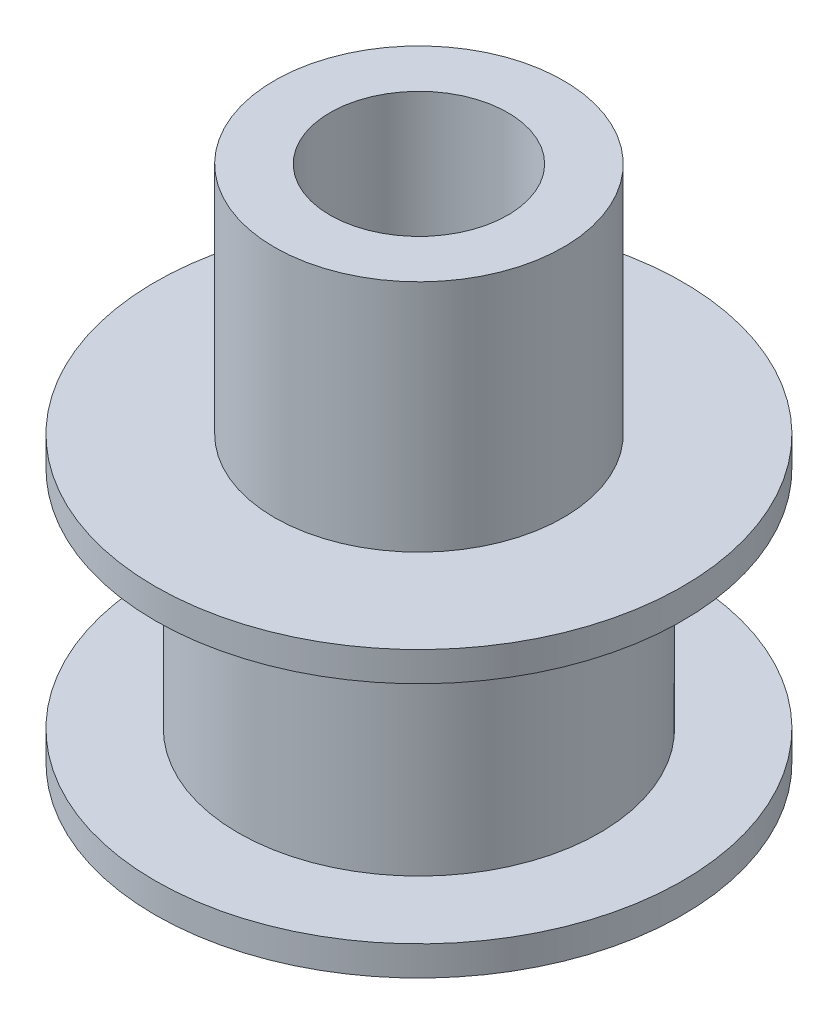
ISO-10303-21;
HEADER;
FILE_DESCRIPTION(('STEP AP214'),'2;1');
FILE_NAME('part.step','',(''),(''),'','','');
FILE_SCHEMA(('AUTOMOTIVE_DESIGN { 1 0 10303 214 1 1 1 1 }'));
ENDSEC;
DATA;
#1=APPLICATION_CONTEXT('core data for automotive mechanical design processes');
#2=APPLICATION_PROTOCOL_DEFINITION('international standard','automotive_design',2000,#1);
#3=PRODUCT_CONTEXT('',#1,'mechanical');
#4=PRODUCT('Part','Part','',(#3));
#5=PRODUCT_RELATED_PRODUCT_CATEGORY('part','',(#4));
#6=PRODUCT_DEFINITION_FORMATION('','',#4);
#7=PRODUCT_DEFINITION_CONTEXT('part definition',#1,'design');
#8=PRODUCT_DEFINITION('design','',#6,#7);
#9=PRODUCT_DEFINITION_SHAPE('','',#8);
#10=(LENGTH_UNIT() NAMED_UNIT(*) SI_UNIT(.MILLI.,.METRE.));
#11=(NAMED_UNIT(*) PLANE_ANGLE_UNIT() SI_UNIT($,.RADIAN.));
#12=(NAMED_UNIT(*) SI_UNIT($,.STERADIAN.) SOLID_ANGLE_UNIT());
#13=UNCERTAINTY_MEASURE_WITH_UNIT(LENGTH_MEASURE(1.E-05),#10,'distance_accuracy_value','');
#14=(GEOMETRIC_REPRESENTATION_CONTEXT(3) GLOBAL_UNCERTAINTY_ASSIGNED_CONTEXT((#13)) GLOBAL_UNIT_ASSIGNED_CONTEXT((#10,
#11,#12)) REPRESENTATION_CONTEXT('',''));
#15=CARTESIAN_POINT('',(0.,0.,0.));
#16=DIRECTION('',(0.,0.,1.));
#17=DIRECTION('',(1.,0.,0.));
#18=AXIS2_PLACEMENT_3D('',#15,#16,#17);
#19=CARTESIAN_POINT('',(0.,1.,0.));
#20=DIRECTION('',(0.,-1.,0.));
#21=DIRECTION('',(0.,0.,-1.));
#22=AXIS2_PLACEMENT_3D('',#19,#20,#21);
#23=CYLINDRICAL_SURFACE('',#22,8.9);
#24=CARTESIAN_POINT('',(0.,1.,0.));
#25=DIRECTION('',(0.,1.,0.));
#26=DIRECTION('',(0.,0.,1.));
#27=AXIS2_PLACEMENT_3D('',#24,#25,#26);
#28=CIRCLE('',#27,8.9);
#29=CARTESIAN_POINT('',(0.,1.,8.9));
#30=VERTEX_POINT('',#29);
#31=EDGE_CURVE('E11',#30,#30,#28,.T.);
#32=ORIENTED_EDGE('',*,*,#31,.F.);
#33=EDGE_LOOP('',(#32));
#34=FACE_BOUND('',#33,.T.);
#35=CARTESIAN_POINT('',(0.,0.,0.));
#36=DIRECTION('',(0.,1.,0.));
#37=DIRECTION('',(0.,0.,1.));
#38=AXIS2_PLACEMENT_3D('',#35,#36,#37);
#39=CIRCLE('',#38,8.9);
#40=CARTESIAN_POINT('',(0.,0.,8.9));
#41=VERTEX_POINT('',#40);
#42=EDGE_CURVE('E37',#41,#41,#39,.T.);
#43=ORIENTED_EDGE('',*,*,#42,.T.);
#44=EDGE_LOOP('',(#43));
#45=FACE_BOUND('',#44,.T.);
#46=ADVANCED_FACE('F34',(#34,#45),#23,.T.);
#47=CARTESIAN_POINT('',(0.,1.,0.));
#48=DIRECTION('',(0.,1.,0.));
#49=DIRECTION('',(0.,0.,1.));
#50=AXIS2_PLACEMENT_3D('',#47,#48,#49);
#51=PLANE('',#50);
#52=CARTESIAN_POINT('',(0.,1.,0.));
#53=DIRECTION('',(0.,1.,0.));
#54=DIRECTION('',(0.,0.,1.));
#55=AXIS2_PLACEMENT_3D('',#52,#53,#54);
#56=CIRCLE('',#55,6.1);
#57=CARTESIAN_POINT('',(0.,1.,6.1));
#58=VERTEX_POINT('',#57);
#59=EDGE_CURVE('E46',#58,#58,#56,.T.);
#60=ORIENTED_EDGE('',*,*,#59,.F.);
#61=EDGE_LOOP('',(#60));
#62=FACE_BOUND('',#61,.T.);
#63=ORIENTED_EDGE('',*,*,#31,.T.);
#64=EDGE_LOOP('',(#63));
#65=FACE_BOUND('',#64,.T.);
#66=ADVANCED_FACE('F92',(#62,#65),#51,.T.);
#67=CARTESIAN_POINT('',(0.,0.,0.));
#68=DIRECTION('',(0.,1.,0.));
#69=DIRECTION('',(0.,0.,1.));
#70=AXIS2_PLACEMENT_3D('',#67,#68,#69);
#71=PLANE('',#70);
#72=CARTESIAN_POINT('',(0.,0.,0.));
#73=DIRECTION('',(0.,1.,0.));
#74=DIRECTION('',(0.,0.,1.));
#75=AXIS2_PLACEMENT_3D('',#72,#73,#74);
#76=CIRCLE('',#75,3.);
#77=CARTESIAN_POINT('',(0.,0.,3.));
#78=VERTEX_POINT('',#77);
#79=EDGE_CURVE('E63',#78,#78,#76,.F.);
#80=ORIENTED_EDGE('',*,*,#79,.F.);
#81=EDGE_LOOP('',(#80));
#82=FACE_BOUND('',#81,.T.);
#83=ORIENTED_EDGE('',*,*,#42,.F.);
#84=EDGE_LOOP('',(#83));
#85=FACE_BOUND('',#84,.T.);
#86=ADVANCED_FACE('F97',(#82,#85),#71,.F.);
#87=CARTESIAN_POINT('',(0.,8.6,0.));
#88=DIRECTION('',(0.,-1.,0.));
#89=DIRECTION('',(0.,0.,-1.));
#90=AXIS2_PLACEMENT_3D('',#87,#88,#89);
#91=CYLINDRICAL_SURFACE('',#90,6.1);
#92=CARTESIAN_POINT('',(0.,8.6,0.));
#93=DIRECTION('',(0.,1.,0.));
#94=DIRECTION('',(0.,0.,1.));
#95=AXIS2_PLACEMENT_3D('',#92,#93,#94);
#96=CIRCLE('',#95,6.1);
#97=CARTESIAN_POINT('',(0.,8.6,6.1));
#98=VERTEX_POINT('',#97);
#99=EDGE_CURVE('E44',#98,#98,#96,.T.);
#100=ORIENTED_EDGE('',*,*,#99,.F.);
#101=EDGE_LOOP('',(#100));
#102=FACE_BOUND('',#101,.T.);
#103=ORIENTED_EDGE('',*,*,#59,.T.);
#104=EDGE_LOOP('',(#103));
#105=FACE_BOUND('',#104,.T.);
#106=ADVANCED_FACE('F104',(#102,#105),#91,.T.);
#107=CARTESIAN_POINT('',(0.,9.6,0.));
#108=DIRECTION('',(0.,-1.,0.));
#109=DIRECTION('',(0.,0.,-1.));
#110=AXIS2_PLACEMENT_3D('',#107,#108,#109);
#111=CYLINDRICAL_SURFACE('',#110,8.9);
#112=CARTESIAN_POINT('',(0.,9.6,0.));
#113=DIRECTION('',(0.,1.,0.));
#114=DIRECTION('',(0.,0.,1.));
#115=AXIS2_PLACEMENT_3D('',#112,#113,#114);
#116=CIRCLE('',#115,8.9);
#117=CARTESIAN_POINT('',(0.,9.6,8.9));
#118=VERTEX_POINT('',#117);
#119=EDGE_CURVE('E49',#118,#118,#116,.T.);
#120=ORIENTED_EDGE('',*,*,#119,.F.);
#121=EDGE_LOOP('',(#120));
#122=FACE_BOUND('',#121,.T.);
#123=CARTESIAN_POINT('',(0.,8.6,0.));
#124=DIRECTION('',(0.,1.,0.));
#125=DIRECTION('',(0.,0.,1.));
#126=AXIS2_PLACEMENT_3D('',#123,#124,#125);
#127=CIRCLE('',#126,8.9);
#128=CARTESIAN_POINT('',(0.,8.6,8.9));
#129=VERTEX_POINT('',#128);
#130=EDGE_CURVE('E52',#129,#129,#127,.T.);
#131=ORIENTED_EDGE('',*,*,#130,.T.);
#132=EDGE_LOOP('',(#131));
#133=FACE_BOUND('',#132,.T.);
#134=ADVANCED_FACE('F109',(#122,#133),#111,.T.);
#135=CARTESIAN_POINT('',(0.,9.6,0.));
#136=DIRECTION('',(0.,1.,0.));
#137=DIRECTION('',(0.,0.,1.));
#138=AXIS2_PLACEMENT_3D('',#135,#136,#137);
#139=PLANE('',#138);
#140=CARTESIAN_POINT('',(0.,9.6,0.));
#141=DIRECTION('',(0.,1.,0.));
#142=DIRECTION('',(0.,0.,1.));
#143=AXIS2_PLACEMENT_3D('',#140,#141,#142);
#144=CIRCLE('',#143,4.875);
#145=CARTESIAN_POINT('',(0.,9.6,4.875));
#146=VERTEX_POINT('',#145);
#147=EDGE_CURVE('E60',#146,#146,#144,.T.);
#148=ORIENTED_EDGE('',*,*,#147,.F.);
#149=EDGE_LOOP('',(#148));
#150=FACE_BOUND('',#149,.T.);
#151=ORIENTED_EDGE('',*,*,#119,.T.);
#152=EDGE_LOOP('',(#151));
#153=FACE_BOUND('',#152,.T.);
#154=ADVANCED_FACE('F87',(#150,#153),#139,.T.);
#155=CARTESIAN_POINT('',(0.,8.6,0.));
#156=DIRECTION('',(0.,1.,0.));
#157=DIRECTION('',(0.,0.,1.));
#158=AXIS2_PLACEMENT_3D('',#155,#156,#157);
#159=PLANE('',#158);
#160=ORIENTED_EDGE('',*,*,#99,.T.);
#161=EDGE_LOOP('',(#160));
#162=FACE_BOUND('',#161,.T.);
#163=ORIENTED_EDGE('',*,*,#130,.F.);
#164=EDGE_LOOP('',(#163));
#165=FACE_BOUND('',#164,.T.);
#166=ADVANCED_FACE('F81',(#162,#165),#159,.F.);
#167=CARTESIAN_POINT('',(0.,48.7885822331377,0.));
#168=DIRECTION('',(0.,-1.,0.));
#169=DIRECTION('',(0.,0.,-1.));
#170=AXIS2_PLACEMENT_3D('',#167,#168,#169);
#171=CYLINDRICAL_SURFACE('',#170,4.875);
#172=ORIENTED_EDGE('',*,*,#147,.T.);
#173=EDGE_LOOP('',(#172));
#174=FACE_BOUND('',#173,.T.);
#175=CARTESIAN_POINT('',(0.,17.5,0.));
#176=DIRECTION('',(0.,1.,0.));
#177=DIRECTION('',(0.,0.,1.));
#178=AXIS2_PLACEMENT_3D('',#175,#176,#177);
#179=CIRCLE('',#178,4.875);
#180=CARTESIAN_POINT('',(0.,17.5,4.875));
#181=VERTEX_POINT('',#180);
#182=EDGE_CURVE('E55',#181,#181,#179,.T.);
#183=ORIENTED_EDGE('',*,*,#182,.F.);
#184=EDGE_LOOP('',(#183));
#185=FACE_BOUND('',#184,.T.);
#186=ADVANCED_FACE('F76',(#174,#185),#171,.T.);
#187=CARTESIAN_POINT('',(0.,17.5,0.));
#188=DIRECTION('',(0.,1.,0.));
#189=DIRECTION('',(0.,0.,1.));
#190=AXIS2_PLACEMENT_3D('',#187,#188,#189);
#191=PLANE('',#190);
#192=CARTESIAN_POINT('',(0.,17.5,0.));
#193=DIRECTION('',(0.,1.,0.));
#194=DIRECTION('',(0.,0.,1.));
#195=AXIS2_PLACEMENT_3D('',#192,#193,#194);
#196=CIRCLE('',#195,3.);
#197=CARTESIAN_POINT('',(0.,17.5,3.));
#198=VERTEX_POINT('',#197);
#199=EDGE_CURVE('E66',#198,#198,#196,.T.);
#200=ORIENTED_EDGE('',*,*,#199,.F.);
#201=EDGE_LOOP('',(#200));
#202=FACE_BOUND('',#201,.T.);
#203=ORIENTED_EDGE('',*,*,#182,.T.);
#204=EDGE_LOOP('',(#203));
#205=FACE_BOUND('',#204,.T.);
#206=ADVANCED_FACE('F73',(#202,#205),#191,.T.);
#207=CARTESIAN_POINT('',(0.,-0.001000000000001,0.));
#208=DIRECTION('',(0.,1.,0.));
#209=DIRECTION('',(0.,0.,1.));
#210=AXIS2_PLACEMENT_3D('',#207,#208,#209);
#211=CYLINDRICAL_SURFACE('',#210,3.);
#212=ORIENTED_EDGE('',*,*,#199,.T.);
#213=EDGE_LOOP('',(#212));
#214=FACE_BOUND('',#213,.T.);
#215=ORIENTED_EDGE('',*,*,#79,.T.);
#216=EDGE_LOOP('',(#215));
#217=FACE_BOUND('',#216,.T.);
#218=ADVANCED_FACE('F70',(#214,#217),#211,.F.);
#219=CLOSED_SHELL('',(#46,#66,#86,#106,#134,#154,#166,#186,#206,#218));
#220=MANIFOLD_SOLID_BREP('B2',#219);
#221=ADVANCED_BREP_SHAPE_REPRESENTATION('',(#18,#220),#14);
#222=SHAPE_DEFINITION_REPRESENTATION(#9,#221);
ENDSEC;
END-ISO-10303-21;
